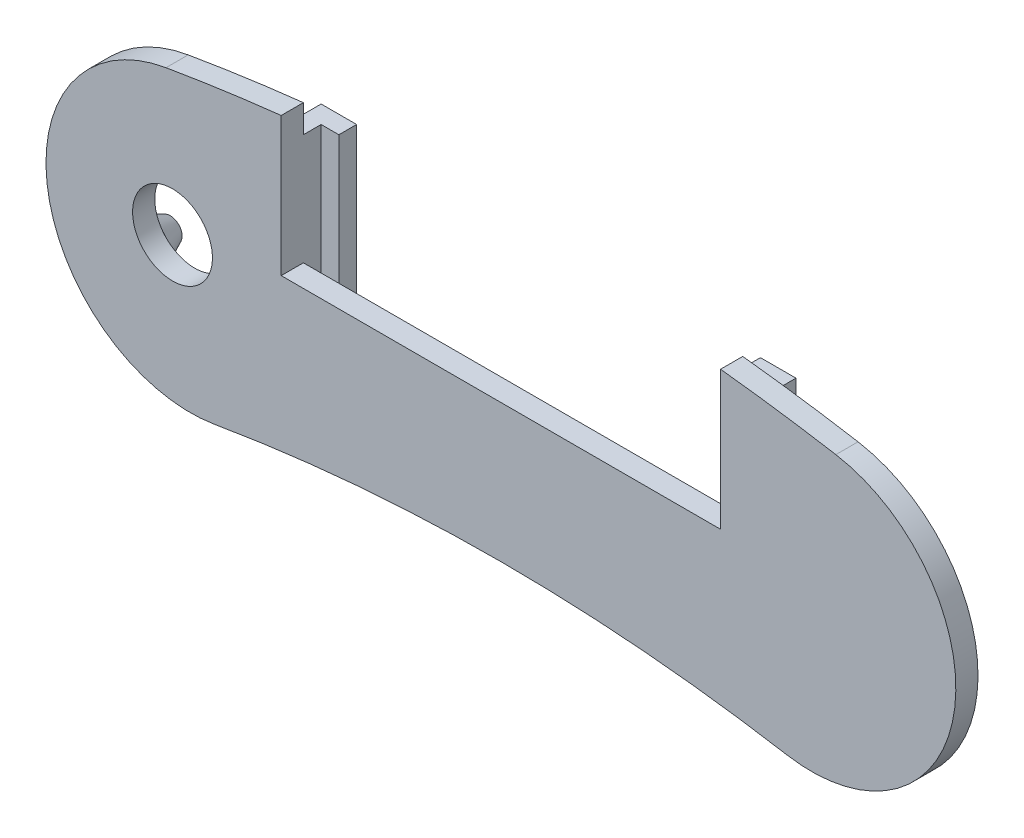
ISO-10303-21;
HEADER;
FILE_DESCRIPTION(('STEP AP214'),'2;1');
FILE_NAME('part.step','',(''),(''),'','','');
FILE_SCHEMA(('AUTOMOTIVE_DESIGN { 1 0 10303 214 1 1 1 1 }'));
ENDSEC;
DATA;
#1=APPLICATION_CONTEXT('core data for automotive mechanical design processes');
#2=APPLICATION_PROTOCOL_DEFINITION('international standard','automotive_design',2000,#1);
#3=PRODUCT_CONTEXT('',#1,'mechanical');
#4=PRODUCT('Part','Part','',(#3));
#5=PRODUCT_RELATED_PRODUCT_CATEGORY('part','',(#4));
#6=PRODUCT_DEFINITION_FORMATION('','',#4);
#7=PRODUCT_DEFINITION_CONTEXT('part definition',#1,'design');
#8=PRODUCT_DEFINITION('design','',#6,#7);
#9=PRODUCT_DEFINITION_SHAPE('','',#8);
#10=(LENGTH_UNIT() NAMED_UNIT(*) SI_UNIT(.MILLI.,.METRE.));
#11=(NAMED_UNIT(*) PLANE_ANGLE_UNIT() SI_UNIT($,.RADIAN.));
#12=(NAMED_UNIT(*) SI_UNIT($,.STERADIAN.) SOLID_ANGLE_UNIT());
#13=UNCERTAINTY_MEASURE_WITH_UNIT(LENGTH_MEASURE(1.E-05),#10,'distance_accuracy_value','');
#14=(GEOMETRIC_REPRESENTATION_CONTEXT(3) GLOBAL_UNCERTAINTY_ASSIGNED_CONTEXT((#13)) GLOBAL_UNIT_ASSIGNED_CONTEXT((#10,
#11,#12)) REPRESENTATION_CONTEXT('',''));
#15=CARTESIAN_POINT('',(0.,0.,0.));
#16=DIRECTION('',(0.,0.,1.));
#17=DIRECTION('',(1.,0.,0.));
#18=AXIS2_PLACEMENT_3D('',#15,#16,#17);
#19=CARTESIAN_POINT('',(-49.4212414035713,413.535495505561,10.));
#20=DIRECTION('',(-1.,0.,0.));
#21=DIRECTION('',(0.,-1.,0.));
#22=AXIS2_PLACEMENT_3D('',#19,#20,#21);
#23=PLANE('',#22);
#24=DIRECTION('',(0.,-1.,0.));
#25=VECTOR('',#24,1.);
#26=CARTESIAN_POINT('',(-49.4212414035713,383.535495505561,-4.));
#27=LINE('',#26,#25);
#28=CARTESIAN_POINT('',(-49.4212414035713,438.535495505561,-4.));
#29=VERTEX_POINT('',#28);
#30=CARTESIAN_POINT('',(-49.4212414035713,383.535495505561,-4.));
#31=VERTEX_POINT('',#30);
#32=EDGE_CURVE('E244',#29,#31,#27,.T.);
#33=ORIENTED_EDGE('',*,*,#32,.F.);
#34=DIRECTION('',(0.,0.,1.));
#35=VECTOR('',#34,1.);
#36=CARTESIAN_POINT('',(-49.4212414035713,438.535495505561,-8.));
#37=LINE('',#36,#35);
#38=CARTESIAN_POINT('',(-49.4212414035713,438.535495505561,0.));
#39=VERTEX_POINT('',#38);
#40=EDGE_CURVE('E63',#29,#39,#37,.T.);
#41=ORIENTED_EDGE('',*,*,#40,.T.);
#42=DIRECTION('',(0.,1.,0.));
#43=VECTOR('',#42,1.);
#44=CARTESIAN_POINT('',(-49.4212414035713,413.535495505561,0.));
#45=LINE('',#44,#43);
#46=CARTESIAN_POINT('',(-49.4212414035713,444.798350114946,0.));
#47=VERTEX_POINT('',#46);
#48=EDGE_CURVE('E213',#39,#47,#45,.T.);
#49=ORIENTED_EDGE('',*,*,#48,.T.);
#50=DIRECTION('',(0.,0.,-1.));
#51=VECTOR('',#50,1.);
#52=CARTESIAN_POINT('',(-49.4212414035713,444.798350114946,5.));
#53=LINE('',#52,#51);
#54=CARTESIAN_POINT('',(-49.4212414035713,444.798350114946,5.));
#55=VERTEX_POINT('',#54);
#56=EDGE_CURVE('E388',#55,#47,#53,.T.);
#57=ORIENTED_EDGE('',*,*,#56,.F.);
#58=DIRECTION('',(0.,-1.,0.));
#59=VECTOR('',#58,1.);
#60=CARTESIAN_POINT('',(-49.4212414035712,204.518453424494,5.));
#61=LINE('',#60,#59);
#62=CARTESIAN_POINT('',(-49.4212414035713,413.535495505561,5.));
#63=VERTEX_POINT('',#62);
#64=EDGE_CURVE('E419',#55,#63,#61,.T.);
#65=ORIENTED_EDGE('',*,*,#64,.T.);
#66=DIRECTION('',(0.,0.,-1.));
#67=VECTOR('',#66,1.);
#68=CARTESIAN_POINT('',(-49.4212414035713,413.535495505561,10.));
#69=LINE('',#68,#67);
#70=CARTESIAN_POINT('',(-49.4212414035713,413.535495505561,0.));
#71=VERTEX_POINT('',#70);
#72=EDGE_CURVE('E422',#63,#71,#69,.T.);
#73=ORIENTED_EDGE('',*,*,#72,.T.);
#74=DIRECTION('',(0.,-1.,0.));
#75=VECTOR('',#74,1.);
#76=CARTESIAN_POINT('',(-49.4212414035713,438.535495505561,0.));
#77=LINE('',#76,#75);
#78=CARTESIAN_POINT('',(-49.4212414035713,383.535495505561,0.));
#79=VERTEX_POINT('',#78);
#80=EDGE_CURVE('E293',#71,#79,#77,.T.);
#81=ORIENTED_EDGE('',*,*,#80,.T.);
#82=DIRECTION('',(0.,0.,1.));
#83=VECTOR('',#82,1.);
#84=CARTESIAN_POINT('',(-49.4212414035713,383.535495505561,-8.));
#85=LINE('',#84,#83);
#86=EDGE_CURVE('E325',#31,#79,#85,.T.);
#87=ORIENTED_EDGE('',*,*,#86,.F.);
#88=EDGE_LOOP('',(#33,#41,#49,#57,#65,#73,#81,#87));
#89=FACE_BOUND('',#88,.T.);
#90=ADVANCED_FACE('F39',(#89),#23,.F.);
#91=CARTESIAN_POINT('',(49.6029206584224,413.535495505561,10.));
#92=DIRECTION('',(-1.,0.,0.));
#93=DIRECTION('',(0.,0.,1.));
#94=AXIS2_PLACEMENT_3D('',#91,#92,#93);
#95=PLANE('',#94);
#96=DIRECTION('',(0.,0.,1.));
#97=VECTOR('',#96,1.);
#98=CARTESIAN_POINT('',(49.6029206584224,438.535495505561,-8.));
#99=LINE('',#98,#97);
#100=CARTESIAN_POINT('',(49.6029206584224,438.535495505561,-4.));
#101=VERTEX_POINT('',#100);
#102=CARTESIAN_POINT('',(49.6029206584224,438.535495505561,0.));
#103=VERTEX_POINT('',#102);
#104=EDGE_CURVE('E358',#101,#103,#99,.T.);
#105=ORIENTED_EDGE('',*,*,#104,.F.);
#106=DIRECTION('',(0.,1.,0.));
#107=VECTOR('',#106,1.);
#108=CARTESIAN_POINT('',(49.6029206584224,438.535495505561,-4.));
#109=LINE('',#108,#107);
#110=CARTESIAN_POINT('',(49.6029206584224,383.535495505561,-3.99999999999999));
#111=VERTEX_POINT('',#110);
#112=EDGE_CURVE('E269',#111,#101,#109,.T.);
#113=ORIENTED_EDGE('',*,*,#112,.F.);
#114=DIRECTION('',(0.,0.,1.));
#115=VECTOR('',#114,1.);
#116=CARTESIAN_POINT('',(49.6029206584223,383.535495505561,-8.));
#117=LINE('',#116,#115);
#118=CARTESIAN_POINT('',(49.6029206584223,383.535495505561,0.));
#119=VERTEX_POINT('',#118);
#120=EDGE_CURVE('E361',#111,#119,#117,.T.);
#121=ORIENTED_EDGE('',*,*,#120,.T.);
#122=DIRECTION('',(0.,1.,0.));
#123=VECTOR('',#122,1.);
#124=CARTESIAN_POINT('',(49.6029206584224,438.535495505561,0.));
#125=LINE('',#124,#123);
#126=CARTESIAN_POINT('',(49.6029206584224,413.535495505561,0.));
#127=VERTEX_POINT('',#126);
#128=EDGE_CURVE('E348',#119,#127,#125,.T.);
#129=ORIENTED_EDGE('',*,*,#128,.T.);
#130=DIRECTION('',(0.,0.,-1.));
#131=VECTOR('',#130,1.);
#132=CARTESIAN_POINT('',(49.6029206584224,413.535495505561,10.));
#133=LINE('',#132,#131);
#134=CARTESIAN_POINT('',(49.6029206584224,413.535495505561,5.));
#135=VERTEX_POINT('',#134);
#136=EDGE_CURVE('E423',#135,#127,#133,.T.);
#137=ORIENTED_EDGE('',*,*,#136,.F.);
#138=DIRECTION('',(0.,-1.,0.));
#139=VECTOR('',#138,1.);
#140=CARTESIAN_POINT('',(49.6029206584224,204.518453424494,5.));
#141=LINE('',#140,#139);
#142=CARTESIAN_POINT('',(49.6029206584224,444.778126293327,5.));
#143=VERTEX_POINT('',#142);
#144=EDGE_CURVE('E412',#143,#135,#141,.T.);
#145=ORIENTED_EDGE('',*,*,#144,.F.);
#146=DIRECTION('',(0.,0.,-1.));
#147=VECTOR('',#146,1.);
#148=CARTESIAN_POINT('',(49.6029206584224,444.778126293327,5.));
#149=LINE('',#148,#147);
#150=CARTESIAN_POINT('',(49.6029206584224,444.778126293327,0.));
#151=VERTEX_POINT('',#150);
#152=EDGE_CURVE('E429',#143,#151,#149,.T.);
#153=ORIENTED_EDGE('',*,*,#152,.T.);
#154=DIRECTION('',(0.,1.,0.));
#155=VECTOR('',#154,1.);
#156=CARTESIAN_POINT('',(49.6029206584224,413.535495505561,0.));
#157=LINE('',#156,#155);
#158=EDGE_CURVE('E220',#103,#151,#157,.T.);
#159=ORIENTED_EDGE('',*,*,#158,.F.);
#160=EDGE_LOOP('',(#105,#113,#121,#129,#137,#145,#153,#159));
#161=FACE_BOUND('',#160,.T.);
#162=ADVANCED_FACE('F453',(#161),#95,.T.);
#163=CARTESIAN_POINT('',(35.0492825725854,204.518453424494,0.));
#164=DIRECTION('',(0.,0.,1.));
#165=DIRECTION('',(1.,0.,0.));
#166=AXIS2_PLACEMENT_3D('',#163,#164,#165);
#167=PLANE('',#166);
#168=CARTESIAN_POINT('',(-73.9212414035713,429.238260820818,0.));
#169=DIRECTION('',(0.,0.,1.));
#170=DIRECTION('',(1.,0.,0.));
#171=AXIS2_PLACEMENT_3D('',#168,#169,#170);
#172=CIRCLE('',#171,5.00000000000001);
#173=CARTESIAN_POINT('',(-68.9212414035713,429.238260820818,0.));
#174=VERTEX_POINT('',#173);
#175=EDGE_CURVE('E11',#174,#174,#172,.F.);
#176=ORIENTED_EDGE('',*,*,#175,.F.);
#177=EDGE_LOOP('',(#176));
#178=FACE_BOUND('',#177,.T.);
#179=CARTESIAN_POINT('',(-84.4212414035713,400.070641788748,0.));
#180=DIRECTION('',(0.,0.,1.));
#181=DIRECTION('',(1.,0.,0.));
#182=AXIS2_PLACEMENT_3D('',#179,#180,#181);
#183=CIRCLE('',#182,5.00000000000001);
#184=CARTESIAN_POINT('',(-80.2730955537952,402.862215898275,0.));
#185=VERTEX_POINT('',#184);
#186=CARTESIAN_POINT('',(-81.095709482766,403.804384876281,0.));
#187=VERTEX_POINT('',#186);
#188=EDGE_CURVE('E217',#185,#187,#183,.F.);
#189=ORIENTED_EDGE('',*,*,#188,.F.);
#190=CARTESIAN_POINT('',(-73.9212414035713,409.238260820818,0.));
#191=DIRECTION('',(0.,0.,-1.));
#192=DIRECTION('',(-1.,0.,0.));
#193=AXIS2_PLACEMENT_3D('',#190,#191,#192);
#194=CIRCLE('',#193,9.00000000000001);
#195=CARTESIAN_POINT('',(-67.5693872533474,402.862215898275,0.));
#196=VERTEX_POINT('',#195);
#197=EDGE_CURVE('E55',#196,#185,#194,.T.);
#198=ORIENTED_EDGE('',*,*,#197,.F.);
#199=CARTESIAN_POINT('',(-63.4212414035713,400.070641788748,0.));
#200=DIRECTION('',(0.,0.,1.));
#201=DIRECTION('',(1.,0.,0.));
#202=AXIS2_PLACEMENT_3D('',#199,#200,#201);
#203=CIRCLE('',#202,5.00000000000001);
#204=CARTESIAN_POINT('',(-66.7467733243765,403.804384876281,0.));
#205=VERTEX_POINT('',#204);
#206=EDGE_CURVE('E208',#205,#196,#203,.F.);
#207=ORIENTED_EDGE('',*,*,#206,.F.);
#208=EDGE_CURVE('E190',#187,#205,#194,.T.);
#209=ORIENTED_EDGE('',*,*,#208,.F.);
#210=EDGE_LOOP('',(#189,#198,#207,#209));
#211=FACE_BOUND('',#210,.T.);
#212=ORIENTED_EDGE('',*,*,#80,.F.);
#213=DIRECTION('',(1.,0.,0.));
#214=VECTOR('',#213,1.);
#215=CARTESIAN_POINT('',(-49.4212414035713,413.535495505561,0.));
#216=LINE('',#215,#214);
#217=EDGE_CURVE('E428',#71,#127,#216,.T.);
#218=ORIENTED_EDGE('',*,*,#217,.T.);
#219=ORIENTED_EDGE('',*,*,#128,.F.);
#220=DIRECTION('',(-1.,0.,0.));
#221=VECTOR('',#220,1.);
#222=CARTESIAN_POINT('',(53.6029206584223,383.535495505561,0.));
#223=LINE('',#222,#221);
#224=CARTESIAN_POINT('',(53.6029206584223,383.535495505561,0.));
#225=VERTEX_POINT('',#224);
#226=EDGE_CURVE('E344',#225,#119,#223,.T.);
#227=ORIENTED_EDGE('',*,*,#226,.F.);
#228=DIRECTION('',(0.,-1.,0.));
#229=VECTOR('',#228,1.);
#230=CARTESIAN_POINT('',(53.6029206584223,438.535495505561,0.));
#231=LINE('',#230,#229);
#232=CARTESIAN_POINT('',(53.6029206584223,438.535495505561,0.));
#233=VERTEX_POINT('',#232);
#234=EDGE_CURVE('E328',#233,#225,#231,.T.);
#235=ORIENTED_EDGE('',*,*,#234,.F.);
#236=DIRECTION('',(1.,0.,0.));
#237=VECTOR('',#236,1.);
#238=CARTESIAN_POINT('',(53.6029206584223,438.535495505561,0.));
#239=LINE('',#238,#237);
#240=EDGE_CURVE('E334',#103,#233,#239,.T.);
#241=ORIENTED_EDGE('',*,*,#240,.F.);
#242=ORIENTED_EDGE('',*,*,#158,.T.);
#243=CARTESIAN_POINT('',(0.,0.,0.));
#244=DIRECTION('',(0.,0.,1.));
#245=DIRECTION('',(1.,0.,0.));
#246=AXIS2_PLACEMENT_3D('',#243,#244,#245);
#247=CIRCLE('',#246,447.535508498318);
#248=CARTESIAN_POINT('',(75.5942096319194,441.104915906606,0.));
#249=VERTEX_POINT('',#248);
#250=EDGE_CURVE('E372',#249,#151,#247,.T.);
#251=ORIENTED_EDGE('',*,*,#250,.F.);
#252=CARTESIAN_POINT('',(70.0985651451709,409.036906848989,0.));
#253=DIRECTION('',(0.,0.,1.));
#254=DIRECTION('',(1.,0.,0.));
#255=AXIS2_PLACEMENT_3D('',#252,#253,#254);
#256=CIRCLE('',#255,32.5355084983184);
#257=CARTESIAN_POINT('',(64.6029206584223,376.968897791371,0.));
#258=VERTEX_POINT('',#257);
#259=EDGE_CURVE('E389',#258,#249,#256,.T.);
#260=ORIENTED_EDGE('',*,*,#259,.F.);
#261=CARTESIAN_POINT('',(0.,0.,0.));
#262=DIRECTION('',(0.,0.,-1.));
#263=DIRECTION('',(1.,0.,0.));
#264=AXIS2_PLACEMENT_3D('',#261,#262,#263);
#265=CIRCLE('',#264,382.464491501681);
#266=CARTESIAN_POINT('',(-64.4212414035713,376.999987951807,0.));
#267=VERTEX_POINT('',#266);
#268=EDGE_CURVE('E377',#267,#258,#265,.T.);
#269=ORIENTED_EDGE('',*,*,#268,.F.);
#270=CARTESIAN_POINT('',(-69.9014307903785,409.070641788748,0.));
#271=DIRECTION('',(0.,0.,1.));
#272=DIRECTION('',(1.,0.,0.));
#273=AXIS2_PLACEMENT_3D('',#270,#271,#272);
#274=CIRCLE('',#273,32.5355084983184);
#275=CARTESIAN_POINT('',(-75.3816201771856,441.141295625688,0.));
#276=VERTEX_POINT('',#275);
#277=EDGE_CURVE('E378',#276,#267,#274,.T.);
#278=ORIENTED_EDGE('',*,*,#277,.F.);
#279=EDGE_CURVE('E394',#47,#276,#247,.T.);
#280=ORIENTED_EDGE('',*,*,#279,.F.);
#281=ORIENTED_EDGE('',*,*,#48,.F.);
#282=DIRECTION('',(1.,0.,0.));
#283=VECTOR('',#282,1.);
#284=CARTESIAN_POINT('',(-49.4212414035713,438.535495505561,0.));
#285=LINE('',#284,#283);
#286=CARTESIAN_POINT('',(-53.4212414035713,438.535495505561,0.));
#287=VERTEX_POINT('',#286);
#288=EDGE_CURVE('E298',#287,#39,#285,.T.);
#289=ORIENTED_EDGE('',*,*,#288,.F.);
#290=DIRECTION('',(0.,1.,0.));
#291=VECTOR('',#290,1.);
#292=CARTESIAN_POINT('',(-53.4212414035713,438.535495505561,0.));
#293=LINE('',#292,#291);
#294=CARTESIAN_POINT('',(-53.4212414035713,383.535495505561,0.));
#295=VERTEX_POINT('',#294);
#296=EDGE_CURVE('E310',#295,#287,#293,.T.);
#297=ORIENTED_EDGE('',*,*,#296,.F.);
#298=DIRECTION('',(-1.,0.,0.));
#299=VECTOR('',#298,1.);
#300=CARTESIAN_POINT('',(-49.4212414035713,383.535495505561,0.));
#301=LINE('',#300,#299);
#302=EDGE_CURVE('E307',#79,#295,#301,.T.);
#303=ORIENTED_EDGE('',*,*,#302,.F.);
#304=EDGE_LOOP('',(#212,#218,#219,#227,#235,#241,#242,#251,#260,#269,#278,#280,#281,#289,#297,#303));
#305=FACE_BOUND('',#304,.T.);
#306=ADVANCED_FACE('F209',(#178,#211,#305),#167,.F.);
#307=CARTESIAN_POINT('',(0.,0.,5.));
#308=DIRECTION('',(0.,0.,-1.));
#309=DIRECTION('',(-1.,0.,0.));
#310=AXIS2_PLACEMENT_3D('',#307,#308,#309);
#311=CYLINDRICAL_SURFACE('',#310,447.535508498318);
#312=ORIENTED_EDGE('',*,*,#152,.F.);
#313=CARTESIAN_POINT('',(0.,0.,5.));
#314=DIRECTION('',(0.,0.,1.));
#315=DIRECTION('',(1.,0.,0.));
#316=AXIS2_PLACEMENT_3D('',#313,#314,#315);
#317=CIRCLE('',#316,447.535508498318);
#318=CARTESIAN_POINT('',(75.5942096319194,441.104915906606,5.));
#319=VERTEX_POINT('',#318);
#320=EDGE_CURVE('E408',#319,#143,#317,.T.);
#321=ORIENTED_EDGE('',*,*,#320,.F.);
#322=DIRECTION('',(0.,0.,-1.));
#323=VECTOR('',#322,1.);
#324=CARTESIAN_POINT('',(75.5942096319194,441.104915906606,5.));
#325=LINE('',#324,#323);
#326=EDGE_CURVE('E368',#319,#249,#325,.T.);
#327=ORIENTED_EDGE('',*,*,#326,.T.);
#328=ORIENTED_EDGE('',*,*,#250,.T.);
#329=EDGE_LOOP('',(#312,#321,#327,#328));
#330=FACE_BOUND('',#329,.T.);
#331=ADVANCED_FACE('F456',(#330),#311,.T.);
#332=CARTESIAN_POINT('',(70.0985651451709,409.036906848989,5.));
#333=DIRECTION('',(0.,0.,-1.));
#334=DIRECTION('',(-1.,0.,0.));
#335=AXIS2_PLACEMENT_3D('',#332,#333,#334);
#336=CYLINDRICAL_SURFACE('',#335,32.5355084983184);
#337=ORIENTED_EDGE('',*,*,#259,.T.);
#338=ORIENTED_EDGE('',*,*,#326,.F.);
#339=CARTESIAN_POINT('',(70.0985651451709,409.036906848989,5.));
#340=DIRECTION('',(0.,0.,1.));
#341=DIRECTION('',(1.,0.,0.));
#342=AXIS2_PLACEMENT_3D('',#339,#340,#341);
#343=CIRCLE('',#342,32.5355084983184);
#344=CARTESIAN_POINT('',(64.6029206584223,376.968897791371,5.));
#345=VERTEX_POINT('',#344);
#346=EDGE_CURVE('E404',#345,#319,#343,.T.);
#347=ORIENTED_EDGE('',*,*,#346,.F.);
#348=DIRECTION('',(0.,0.,-1.));
#349=VECTOR('',#348,1.);
#350=CARTESIAN_POINT('',(64.6029206584223,376.968897791371,5.));
#351=LINE('',#350,#349);
#352=EDGE_CURVE('E384',#345,#258,#351,.T.);
#353=ORIENTED_EDGE('',*,*,#352,.T.);
#354=EDGE_LOOP('',(#337,#338,#347,#353));
#355=FACE_BOUND('',#354,.T.);
#356=ADVANCED_FACE('F460',(#355),#336,.T.);
#357=CARTESIAN_POINT('',(-75.3816201771856,441.141295625688,5.));
#358=VERTEX_POINT('',#357);
#359=EDGE_CURVE('E383',#55,#358,#317,.T.);
#360=ORIENTED_EDGE('',*,*,#359,.F.);
#361=ORIENTED_EDGE('',*,*,#56,.T.);
#362=ORIENTED_EDGE('',*,*,#279,.T.);
#363=DIRECTION('',(0.,0.,-1.));
#364=VECTOR('',#363,1.);
#365=CARTESIAN_POINT('',(-75.3816201771856,441.141295625688,5.));
#366=LINE('',#365,#364);
#367=EDGE_CURVE('E373',#358,#276,#366,.T.);
#368=ORIENTED_EDGE('',*,*,#367,.F.);
#369=EDGE_LOOP('',(#360,#361,#362,#368));
#370=FACE_BOUND('',#369,.T.);
#371=ADVANCED_FACE('F41',(#370),#311,.T.);
#372=CARTESIAN_POINT('',(-69.9014307903785,409.070641788748,5.));
#373=DIRECTION('',(0.,0.,-1.));
#374=DIRECTION('',(-1.,0.,0.));
#375=AXIS2_PLACEMENT_3D('',#372,#373,#374);
#376=CYLINDRICAL_SURFACE('',#375,32.5355084983184);
#377=ORIENTED_EDGE('',*,*,#277,.T.);
#378=DIRECTION('',(0.,0.,-1.));
#379=VECTOR('',#378,1.);
#380=CARTESIAN_POINT('',(-64.4212414035713,376.999987951807,5.));
#381=LINE('',#380,#379);
#382=CARTESIAN_POINT('',(-64.4212414035713,376.999987951807,5.));
#383=VERTEX_POINT('',#382);
#384=EDGE_CURVE('E379',#383,#267,#381,.T.);
#385=ORIENTED_EDGE('',*,*,#384,.F.);
#386=CARTESIAN_POINT('',(-69.9014307903785,409.070641788748,5.));
#387=DIRECTION('',(0.,0.,1.));
#388=DIRECTION('',(1.,0.,0.));
#389=AXIS2_PLACEMENT_3D('',#386,#387,#388);
#390=CIRCLE('',#389,32.5355084983184);
#391=EDGE_CURVE('E405',#358,#383,#390,.T.);
#392=ORIENTED_EDGE('',*,*,#391,.F.);
#393=ORIENTED_EDGE('',*,*,#367,.T.);
#394=EDGE_LOOP('',(#377,#385,#392,#393));
#395=FACE_BOUND('',#394,.T.);
#396=ADVANCED_FACE('F471',(#395),#376,.T.);
#397=CARTESIAN_POINT('',(0.,0.,5.));
#398=DIRECTION('',(0.,0.,-1.));
#399=DIRECTION('',(-1.,0.,0.));
#400=AXIS2_PLACEMENT_3D('',#397,#398,#399);
#401=CYLINDRICAL_SURFACE('',#400,382.464491501681);
#402=ORIENTED_EDGE('',*,*,#268,.T.);
#403=ORIENTED_EDGE('',*,*,#352,.F.);
#404=CARTESIAN_POINT('',(0.,0.,5.));
#405=DIRECTION('',(0.,0.,-1.));
#406=DIRECTION('',(1.,0.,0.));
#407=AXIS2_PLACEMENT_3D('',#404,#405,#406);
#408=CIRCLE('',#407,382.464491501681);
#409=EDGE_CURVE('E401',#383,#345,#408,.T.);
#410=ORIENTED_EDGE('',*,*,#409,.F.);
#411=ORIENTED_EDGE('',*,*,#384,.T.);
#412=EDGE_LOOP('',(#402,#403,#410,#411));
#413=FACE_BOUND('',#412,.T.);
#414=ADVANCED_FACE('F466',(#413),#401,.F.);
#415=CARTESIAN_POINT('',(35.0492825725854,204.518453424494,5.));
#416=DIRECTION('',(0.,0.,1.));
#417=DIRECTION('',(1.,0.,0.));
#418=AXIS2_PLACEMENT_3D('',#415,#416,#417);
#419=PLANE('',#418);
#420=CARTESIAN_POINT('',(-73.9212414035713,409.238260820818,5.));
#421=DIRECTION('',(0.,0.,-1.));
#422=DIRECTION('',(-1.,0.,0.));
#423=AXIS2_PLACEMENT_3D('',#420,#421,#422);
#424=CIRCLE('',#423,9.00000000000001);
#425=CARTESIAN_POINT('',(-82.9212414035713,409.238260820818,5.));
#426=VERTEX_POINT('',#425);
#427=EDGE_CURVE('E206',#426,#426,#424,.T.);
#428=ORIENTED_EDGE('',*,*,#427,.T.);
#429=EDGE_LOOP('',(#428));
#430=FACE_BOUND('',#429,.T.);
#431=ORIENTED_EDGE('',*,*,#64,.F.);
#432=ORIENTED_EDGE('',*,*,#359,.T.);
#433=ORIENTED_EDGE('',*,*,#391,.T.);
#434=ORIENTED_EDGE('',*,*,#409,.T.);
#435=ORIENTED_EDGE('',*,*,#346,.T.);
#436=ORIENTED_EDGE('',*,*,#320,.T.);
#437=ORIENTED_EDGE('',*,*,#144,.T.);
#438=DIRECTION('',(-1.,0.,0.));
#439=VECTOR('',#438,1.);
#440=CARTESIAN_POINT('',(35.0492825725854,413.535495505561,5.));
#441=LINE('',#440,#439);
#442=EDGE_CURVE('E424',#135,#63,#441,.T.);
#443=ORIENTED_EDGE('',*,*,#442,.T.);
#444=EDGE_LOOP('',(#431,#432,#433,#434,#435,#436,#437,#443));
#445=FACE_BOUND('',#444,.T.);
#446=ADVANCED_FACE('F481',(#430,#445),#419,.T.);
#447=CARTESIAN_POINT('',(-49.4212414035713,413.535495505561,10.));
#448=DIRECTION('',(0.,1.,0.));
#449=DIRECTION('',(0.,0.,1.));
#450=AXIS2_PLACEMENT_3D('',#447,#448,#449);
#451=PLANE('',#450);
#452=ORIENTED_EDGE('',*,*,#136,.T.);
#453=ORIENTED_EDGE('',*,*,#217,.F.);
#454=ORIENTED_EDGE('',*,*,#72,.F.);
#455=ORIENTED_EDGE('',*,*,#442,.F.);
#456=EDGE_LOOP('',(#452,#453,#454,#455));
#457=FACE_BOUND('',#456,.T.);
#458=ADVANCED_FACE('F497',(#457),#451,.T.);
#459=CARTESIAN_POINT('',(53.6029206584223,438.535495505561,-8.));
#460=DIRECTION('',(-1.,0.,0.));
#461=DIRECTION('',(0.,-1.,0.));
#462=AXIS2_PLACEMENT_3D('',#459,#460,#461);
#463=PLANE('',#462);
#464=ORIENTED_EDGE('',*,*,#234,.T.);
#465=DIRECTION('',(0.,0.,1.));
#466=VECTOR('',#465,1.);
#467=CARTESIAN_POINT('',(53.6029206584223,383.535495505561,-8.));
#468=LINE('',#467,#466);
#469=CARTESIAN_POINT('',(53.6029206584223,383.535495505561,-8.));
#470=VERTEX_POINT('',#469);
#471=EDGE_CURVE('E364',#470,#225,#468,.T.);
#472=ORIENTED_EDGE('',*,*,#471,.F.);
#473=DIRECTION('',(0.,-1.,0.));
#474=VECTOR('',#473,1.);
#475=CARTESIAN_POINT('',(53.6029206584223,438.535495505561,-8.));
#476=LINE('',#475,#474);
#477=CARTESIAN_POINT('',(53.6029206584223,438.535495505561,-8.));
#478=VERTEX_POINT('',#477);
#479=EDGE_CURVE('E329',#478,#470,#476,.T.);
#480=ORIENTED_EDGE('',*,*,#479,.F.);
#481=DIRECTION('',(0.,0.,1.));
#482=VECTOR('',#481,1.);
#483=CARTESIAN_POINT('',(53.6029206584223,438.535495505561,-8.));
#484=LINE('',#483,#482);
#485=EDGE_CURVE('E340',#478,#233,#484,.T.);
#486=ORIENTED_EDGE('',*,*,#485,.T.);
#487=EDGE_LOOP('',(#464,#472,#480,#486));
#488=FACE_BOUND('',#487,.T.);
#489=ADVANCED_FACE('F499',(#488),#463,.F.);
#490=CARTESIAN_POINT('',(53.6029206584223,383.535495505561,-8.));
#491=DIRECTION('',(0.,1.,0.));
#492=DIRECTION('',(0.,0.,1.));
#493=AXIS2_PLACEMENT_3D('',#490,#491,#492);
#494=PLANE('',#493);
#495=ORIENTED_EDGE('',*,*,#226,.T.);
#496=ORIENTED_EDGE('',*,*,#120,.F.);
#497=DIRECTION('',(1.,0.,0.));
#498=VECTOR('',#497,1.);
#499=CARTESIAN_POINT('',(45.6029206584223,383.535495505561,-3.99999999999999));
#500=LINE('',#499,#498);
#501=CARTESIAN_POINT('',(45.6029206584223,383.535495505561,-3.99999999999999));
#502=VERTEX_POINT('',#501);
#503=EDGE_CURVE('E290',#502,#111,#500,.T.);
#504=ORIENTED_EDGE('',*,*,#503,.F.);
#505=DIRECTION('',(0.,0.,1.));
#506=VECTOR('',#505,1.);
#507=CARTESIAN_POINT('',(45.6029206584223,383.535495505561,-7.99999999999999));
#508=LINE('',#507,#506);
#509=CARTESIAN_POINT('',(45.6029206584223,383.535495505561,-7.99999999999999));
#510=VERTEX_POINT('',#509);
#511=EDGE_CURVE('E274',#510,#502,#508,.T.);
#512=ORIENTED_EDGE('',*,*,#511,.F.);
#513=DIRECTION('',(-1.,0.,0.));
#514=VECTOR('',#513,1.);
#515=CARTESIAN_POINT('',(53.6029206584223,383.535495505561,-8.));
#516=LINE('',#515,#514);
#517=EDGE_CURVE('E333',#470,#510,#516,.T.);
#518=ORIENTED_EDGE('',*,*,#517,.F.);
#519=ORIENTED_EDGE('',*,*,#471,.T.);
#520=EDGE_LOOP('',(#495,#496,#504,#512,#518,#519));
#521=FACE_BOUND('',#520,.T.);
#522=ADVANCED_FACE('F515',(#521),#494,.F.);
#523=CARTESIAN_POINT('',(53.6029206584223,438.535495505561,-8.));
#524=DIRECTION('',(0.,-1.,0.));
#525=DIRECTION('',(0.,0.,-1.));
#526=AXIS2_PLACEMENT_3D('',#523,#524,#525);
#527=PLANE('',#526);
#528=ORIENTED_EDGE('',*,*,#240,.T.);
#529=ORIENTED_EDGE('',*,*,#485,.F.);
#530=DIRECTION('',(1.,0.,0.));
#531=VECTOR('',#530,1.);
#532=CARTESIAN_POINT('',(53.6029206584223,438.535495505561,-8.));
#533=LINE('',#532,#531);
#534=CARTESIAN_POINT('',(45.6029206584223,438.535495505561,-8.));
#535=VERTEX_POINT('',#534);
#536=EDGE_CURVE('E337',#535,#478,#533,.T.);
#537=ORIENTED_EDGE('',*,*,#536,.F.);
#538=DIRECTION('',(0.,0.,-1.));
#539=VECTOR('',#538,1.);
#540=CARTESIAN_POINT('',(45.6029206584223,438.535495505561,-8.));
#541=LINE('',#540,#539);
#542=CARTESIAN_POINT('',(45.6029206584223,438.535495505561,-4.));
#543=VERTEX_POINT('',#542);
#544=EDGE_CURVE('E280',#543,#535,#541,.T.);
#545=ORIENTED_EDGE('',*,*,#544,.F.);
#546=DIRECTION('',(1.,0.,0.));
#547=VECTOR('',#546,1.);
#548=CARTESIAN_POINT('',(45.6029206584223,438.535495505561,-4.));
#549=LINE('',#548,#547);
#550=EDGE_CURVE('E284',#543,#101,#549,.T.);
#551=ORIENTED_EDGE('',*,*,#550,.T.);
#552=ORIENTED_EDGE('',*,*,#104,.T.);
#553=EDGE_LOOP('',(#528,#529,#537,#545,#551,#552));
#554=FACE_BOUND('',#553,.T.);
#555=ADVANCED_FACE('F519',(#554),#527,.F.);
#556=CARTESIAN_POINT('',(0.,0.,-8.));
#557=DIRECTION('',(0.,0.,-1.));
#558=DIRECTION('',(-1.,0.,0.));
#559=AXIS2_PLACEMENT_3D('',#556,#557,#558);
#560=PLANE('',#559);
#561=ORIENTED_EDGE('',*,*,#479,.T.);
#562=ORIENTED_EDGE('',*,*,#517,.T.);
#563=DIRECTION('',(0.,-1.,0.));
#564=VECTOR('',#563,1.);
#565=CARTESIAN_POINT('',(45.6029206584223,438.535495505561,-8.));
#566=LINE('',#565,#564);
#567=EDGE_CURVE('E270',#535,#510,#566,.T.);
#568=ORIENTED_EDGE('',*,*,#567,.F.);
#569=ORIENTED_EDGE('',*,*,#536,.T.);
#570=EDGE_LOOP('',(#561,#562,#568,#569));
#571=FACE_BOUND('',#570,.T.);
#572=ADVANCED_FACE('F523',(#571),#560,.T.);
#573=CARTESIAN_POINT('',(-49.4212414035713,383.535495505561,-8.));
#574=DIRECTION('',(0.,1.,0.));
#575=DIRECTION('',(0.,0.,1.));
#576=AXIS2_PLACEMENT_3D('',#573,#574,#575);
#577=PLANE('',#576);
#578=ORIENTED_EDGE('',*,*,#302,.T.);
#579=DIRECTION('',(0.,0.,1.));
#580=VECTOR('',#579,1.);
#581=CARTESIAN_POINT('',(-53.4212414035713,383.535495505561,-8.));
#582=LINE('',#581,#580);
#583=CARTESIAN_POINT('',(-53.4212414035713,383.535495505561,-8.));
#584=VERTEX_POINT('',#583);
#585=EDGE_CURVE('E321',#584,#295,#582,.T.);
#586=ORIENTED_EDGE('',*,*,#585,.F.);
#587=DIRECTION('',(-1.,0.,0.));
#588=VECTOR('',#587,1.);
#589=CARTESIAN_POINT('',(-49.4212414035713,383.535495505561,-8.));
#590=LINE('',#589,#588);
#591=CARTESIAN_POINT('',(-45.4212414035713,383.535495505561,-8.));
#592=VERTEX_POINT('',#591);
#593=EDGE_CURVE('E294',#592,#584,#590,.T.);
#594=ORIENTED_EDGE('',*,*,#593,.F.);
#595=DIRECTION('',(0.,0.,-1.));
#596=VECTOR('',#595,1.);
#597=CARTESIAN_POINT('',(-45.4212414035713,383.535495505561,-4.));
#598=LINE('',#597,#596);
#599=CARTESIAN_POINT('',(-45.4212414035713,383.535495505561,-4.));
#600=VERTEX_POINT('',#599);
#601=EDGE_CURVE('E249',#600,#592,#598,.T.);
#602=ORIENTED_EDGE('',*,*,#601,.F.);
#603=DIRECTION('',(-1.,0.,0.));
#604=VECTOR('',#603,1.);
#605=CARTESIAN_POINT('',(-45.4212414035713,383.535495505561,-4.));
#606=LINE('',#605,#604);
#607=EDGE_CURVE('E266',#600,#31,#606,.T.);
#608=ORIENTED_EDGE('',*,*,#607,.T.);
#609=ORIENTED_EDGE('',*,*,#86,.T.);
#610=EDGE_LOOP('',(#578,#586,#594,#602,#608,#609));
#611=FACE_BOUND('',#610,.T.);
#612=ADVANCED_FACE('F527',(#611),#577,.F.);
#613=CARTESIAN_POINT('',(-53.4212414035713,438.535495505561,-8.));
#614=DIRECTION('',(1.,0.,0.));
#615=DIRECTION('',(0.,1.,0.));
#616=AXIS2_PLACEMENT_3D('',#613,#614,#615);
#617=PLANE('',#616);
#618=ORIENTED_EDGE('',*,*,#296,.T.);
#619=DIRECTION('',(0.,0.,1.));
#620=VECTOR('',#619,1.);
#621=CARTESIAN_POINT('',(-53.4212414035713,438.535495505561,-8.));
#622=LINE('',#621,#620);
#623=CARTESIAN_POINT('',(-53.4212414035713,438.535495505561,-8.));
#624=VERTEX_POINT('',#623);
#625=EDGE_CURVE('E317',#624,#287,#622,.T.);
#626=ORIENTED_EDGE('',*,*,#625,.F.);
#627=DIRECTION('',(0.,1.,0.));
#628=VECTOR('',#627,1.);
#629=CARTESIAN_POINT('',(-53.4212414035713,438.535495505561,-8.));
#630=LINE('',#629,#628);
#631=EDGE_CURVE('E297',#584,#624,#630,.T.);
#632=ORIENTED_EDGE('',*,*,#631,.F.);
#633=ORIENTED_EDGE('',*,*,#585,.T.);
#634=EDGE_LOOP('',(#618,#626,#632,#633));
#635=FACE_BOUND('',#634,.T.);
#636=ADVANCED_FACE('F531',(#635),#617,.F.);
#637=CARTESIAN_POINT('',(-49.4212414035713,438.535495505561,-8.));
#638=DIRECTION('',(0.,-1.,0.));
#639=DIRECTION('',(0.,0.,-1.));
#640=AXIS2_PLACEMENT_3D('',#637,#638,#639);
#641=PLANE('',#640);
#642=ORIENTED_EDGE('',*,*,#288,.T.);
#643=ORIENTED_EDGE('',*,*,#40,.F.);
#644=DIRECTION('',(-1.,0.,0.));
#645=VECTOR('',#644,1.);
#646=CARTESIAN_POINT('',(-45.4212414035713,438.535495505561,-4.));
#647=LINE('',#646,#645);
#648=CARTESIAN_POINT('',(-45.4212414035713,438.535495505561,-4.));
#649=VERTEX_POINT('',#648);
#650=EDGE_CURVE('E260',#649,#29,#647,.T.);
#651=ORIENTED_EDGE('',*,*,#650,.F.);
#652=DIRECTION('',(0.,0.,1.));
#653=VECTOR('',#652,1.);
#654=CARTESIAN_POINT('',(-45.4212414035713,438.535495505561,-4.));
#655=LINE('',#654,#653);
#656=CARTESIAN_POINT('',(-45.4212414035713,438.535495505561,-8.));
#657=VERTEX_POINT('',#656);
#658=EDGE_CURVE('E257',#657,#649,#655,.T.);
#659=ORIENTED_EDGE('',*,*,#658,.F.);
#660=DIRECTION('',(1.,0.,0.));
#661=VECTOR('',#660,1.);
#662=CARTESIAN_POINT('',(-49.4212414035713,438.535495505561,-8.));
#663=LINE('',#662,#661);
#664=EDGE_CURVE('E301',#624,#657,#663,.T.);
#665=ORIENTED_EDGE('',*,*,#664,.F.);
#666=ORIENTED_EDGE('',*,*,#625,.T.);
#667=EDGE_LOOP('',(#642,#643,#651,#659,#665,#666));
#668=FACE_BOUND('',#667,.T.);
#669=ADVANCED_FACE('F535',(#668),#641,.F.);
#670=CARTESIAN_POINT('',(0.,0.,-8.));
#671=DIRECTION('',(0.,0.,-1.));
#672=DIRECTION('',(-1.,0.,0.));
#673=AXIS2_PLACEMENT_3D('',#670,#671,#672);
#674=PLANE('',#673);
#675=ORIENTED_EDGE('',*,*,#664,.T.);
#676=DIRECTION('',(0.,1.,0.));
#677=VECTOR('',#676,1.);
#678=CARTESIAN_POINT('',(-45.4212414035713,383.535495505561,-8.));
#679=LINE('',#678,#677);
#680=EDGE_CURVE('E253',#592,#657,#679,.T.);
#681=ORIENTED_EDGE('',*,*,#680,.F.);
#682=ORIENTED_EDGE('',*,*,#593,.T.);
#683=ORIENTED_EDGE('',*,*,#631,.T.);
#684=EDGE_LOOP('',(#675,#681,#682,#683));
#685=FACE_BOUND('',#684,.T.);
#686=ADVANCED_FACE('F539',(#685),#674,.T.);
#687=CARTESIAN_POINT('',(45.6029206584223,438.535495505561,-4.));
#688=DIRECTION('',(0.,0.,-1.));
#689=DIRECTION('',(0.,1.,0.));
#690=AXIS2_PLACEMENT_3D('',#687,#688,#689);
#691=PLANE('',#690);
#692=ORIENTED_EDGE('',*,*,#112,.T.);
#693=ORIENTED_EDGE('',*,*,#550,.F.);
#694=DIRECTION('',(0.,1.,0.));
#695=VECTOR('',#694,1.);
#696=CARTESIAN_POINT('',(45.6029206584223,438.535495505561,-4.));
#697=LINE('',#696,#695);
#698=EDGE_CURVE('E277',#502,#543,#697,.T.);
#699=ORIENTED_EDGE('',*,*,#698,.F.);
#700=ORIENTED_EDGE('',*,*,#503,.T.);
#701=EDGE_LOOP('',(#692,#693,#699,#700));
#702=FACE_BOUND('',#701,.T.);
#703=ADVANCED_FACE('F543',(#702),#691,.F.);
#704=CARTESIAN_POINT('',(45.6029206584223,0.,0.));
#705=DIRECTION('',(-1.,0.,0.));
#706=DIRECTION('',(0.,0.,1.));
#707=AXIS2_PLACEMENT_3D('',#704,#705,#706);
#708=PLANE('',#707);
#709=ORIENTED_EDGE('',*,*,#567,.T.);
#710=ORIENTED_EDGE('',*,*,#511,.T.);
#711=ORIENTED_EDGE('',*,*,#698,.T.);
#712=ORIENTED_EDGE('',*,*,#544,.T.);
#713=EDGE_LOOP('',(#709,#710,#711,#712));
#714=FACE_BOUND('',#713,.T.);
#715=ADVANCED_FACE('F547',(#714),#708,.T.);
#716=CARTESIAN_POINT('',(-45.4212414035713,383.535495505561,-4.));
#717=DIRECTION('',(0.,0.,-1.));
#718=DIRECTION('',(-1.,0.,0.));
#719=AXIS2_PLACEMENT_3D('',#716,#717,#718);
#720=PLANE('',#719);
#721=ORIENTED_EDGE('',*,*,#32,.T.);
#722=ORIENTED_EDGE('',*,*,#607,.F.);
#723=DIRECTION('',(0.,-1.,0.));
#724=VECTOR('',#723,1.);
#725=CARTESIAN_POINT('',(-45.4212414035713,383.535495505561,-4.));
#726=LINE('',#725,#724);
#727=EDGE_CURVE('E245',#649,#600,#726,.T.);
#728=ORIENTED_EDGE('',*,*,#727,.F.);
#729=ORIENTED_EDGE('',*,*,#650,.T.);
#730=EDGE_LOOP('',(#721,#722,#728,#729));
#731=FACE_BOUND('',#730,.T.);
#732=ADVANCED_FACE('F551',(#731),#720,.F.);
#733=CARTESIAN_POINT('',(-45.4212414035712,0.,0.));
#734=DIRECTION('',(-1.,0.,0.));
#735=DIRECTION('',(0.,-1.,0.));
#736=AXIS2_PLACEMENT_3D('',#733,#734,#735);
#737=PLANE('',#736);
#738=ORIENTED_EDGE('',*,*,#727,.T.);
#739=ORIENTED_EDGE('',*,*,#601,.T.);
#740=ORIENTED_EDGE('',*,*,#680,.T.);
#741=ORIENTED_EDGE('',*,*,#658,.T.);
#742=EDGE_LOOP('',(#738,#739,#740,#741));
#743=FACE_BOUND('',#742,.T.);
#744=ADVANCED_FACE('F555',(#743),#737,.F.);
#745=CARTESIAN_POINT('',(-63.4212414035713,400.070641788748,0.));
#746=DIRECTION('',(0.,0.,1.));
#747=DIRECTION('',(-1.,0.,0.));
#748=AXIS2_PLACEMENT_3D('',#745,#746,#747);
#749=CONICAL_SURFACE('',#748,5.00000000000001,0.436332312998583);
#750=CARTESIAN_POINT('',(-63.4212414035713,400.070641788748,-5.));
#751=DIRECTION('',(0.,0.,-1.));
#752=DIRECTION('',(-1.,0.,0.));
#753=AXIS2_PLACEMENT_3D('',#750,#751,#752);
#754=CIRCLE('',#753,2.66846170922501);
#755=CARTESIAN_POINT('',(-66.0897031127963,400.070641788748,-5.));
#756=VERTEX_POINT('',#755);
#757=EDGE_CURVE('E240',#756,#756,#754,.T.);
#758=ORIENTED_EDGE('',*,*,#757,.F.);
#759=EDGE_LOOP('',(#758));
#760=FACE_BOUND('',#759,.T.);
#761=EDGE_CURVE('E204',#196,#205,#203,.F.);
#762=ORIENTED_EDGE('',*,*,#761,.T.);
#763=ORIENTED_EDGE('',*,*,#206,.T.);
#764=EDGE_LOOP('',(#762,#763));
#765=FACE_BOUND('',#764,.T.);
#766=ADVANCED_FACE('F215',(#760,#765),#749,.T.);
#767=CARTESIAN_POINT('',(-63.4212414035713,400.070641788748,-5.));
#768=DIRECTION('',(0.,0.,-1.));
#769=DIRECTION('',(-1.,0.,0.));
#770=AXIS2_PLACEMENT_3D('',#767,#768,#769);
#771=PLANE('',#770);
#772=ORIENTED_EDGE('',*,*,#757,.T.);
#773=EDGE_LOOP('',(#772));
#774=FACE_BOUND('',#773,.T.);
#775=ADVANCED_FACE('F562',(#774),#771,.T.);
#776=CARTESIAN_POINT('',(-84.4212414035713,400.070641788748,0.));
#777=DIRECTION('',(0.,0.,1.));
#778=DIRECTION('',(-1.,0.,0.));
#779=AXIS2_PLACEMENT_3D('',#776,#777,#778);
#780=CONICAL_SURFACE('',#779,5.00000000000001,0.436332312998583);
#781=CARTESIAN_POINT('',(-84.4212414035713,400.070641788748,-5.));
#782=DIRECTION('',(0.,0.,-1.));
#783=DIRECTION('',(-1.,0.,0.));
#784=AXIS2_PLACEMENT_3D('',#781,#782,#783);
#785=CIRCLE('',#784,2.66846170922501);
#786=CARTESIAN_POINT('',(-87.0897031127963,400.070641788748,-5.));
#787=VERTEX_POINT('',#786);
#788=EDGE_CURVE('E236',#787,#787,#785,.T.);
#789=ORIENTED_EDGE('',*,*,#788,.F.);
#790=EDGE_LOOP('',(#789));
#791=FACE_BOUND('',#790,.T.);
#792=EDGE_CURVE('E48',#187,#185,#183,.F.);
#793=ORIENTED_EDGE('',*,*,#792,.T.);
#794=ORIENTED_EDGE('',*,*,#188,.T.);
#795=EDGE_LOOP('',(#793,#794));
#796=FACE_BOUND('',#795,.T.);
#797=ADVANCED_FACE('F225',(#791,#796),#780,.T.);
#798=CARTESIAN_POINT('',(-84.4212414035713,400.070641788748,-5.));
#799=DIRECTION('',(0.,0.,-1.));
#800=DIRECTION('',(-1.,0.,0.));
#801=AXIS2_PLACEMENT_3D('',#798,#799,#800);
#802=PLANE('',#801);
#803=ORIENTED_EDGE('',*,*,#788,.T.);
#804=EDGE_LOOP('',(#803));
#805=FACE_BOUND('',#804,.T.);
#806=ADVANCED_FACE('F569',(#805),#802,.T.);
#807=CARTESIAN_POINT('',(-73.9212414035713,429.238260820818,0.));
#808=DIRECTION('',(0.,0.,1.));
#809=DIRECTION('',(-1.,0.,0.));
#810=AXIS2_PLACEMENT_3D('',#807,#808,#809);
#811=CONICAL_SURFACE('',#810,5.00000000000001,0.436332312998583);
#812=CARTESIAN_POINT('',(-73.9212414035713,429.238260820818,-5.));
#813=DIRECTION('',(0.,0.,-1.));
#814=DIRECTION('',(-1.,0.,0.));
#815=AXIS2_PLACEMENT_3D('',#812,#813,#814);
#816=CIRCLE('',#815,2.66846170922501);
#817=CARTESIAN_POINT('',(-76.5897031127963,429.238260820818,-5.));
#818=VERTEX_POINT('',#817);
#819=EDGE_CURVE('E232',#818,#818,#816,.T.);
#820=ORIENTED_EDGE('',*,*,#819,.F.);
#821=EDGE_LOOP('',(#820));
#822=FACE_BOUND('',#821,.T.);
#823=ORIENTED_EDGE('',*,*,#175,.T.);
#824=EDGE_LOOP('',(#823));
#825=FACE_BOUND('',#824,.T.);
#826=ADVANCED_FACE('F573',(#822,#825),#811,.T.);
#827=CARTESIAN_POINT('',(-73.9212414035713,429.238260820818,-5.));
#828=DIRECTION('',(0.,0.,-1.));
#829=DIRECTION('',(-1.,0.,0.));
#830=AXIS2_PLACEMENT_3D('',#827,#828,#829);
#831=PLANE('',#830);
#832=ORIENTED_EDGE('',*,*,#819,.T.);
#833=EDGE_LOOP('',(#832));
#834=FACE_BOUND('',#833,.T.);
#835=ADVANCED_FACE('F576',(#834),#831,.T.);
#836=CARTESIAN_POINT('',(-73.9212414035713,409.238260820818,0.));
#837=DIRECTION('',(0.,0.,-1.));
#838=DIRECTION('',(-1.,0.,0.));
#839=AXIS2_PLACEMENT_3D('',#836,#837,#838);
#840=PLANE('',#839);
#841=EDGE_CURVE('E193',#205,#196,#194,.T.);
#842=ORIENTED_EDGE('',*,*,#841,.F.);
#843=ORIENTED_EDGE('',*,*,#761,.F.);
#844=EDGE_LOOP('',(#842,#843));
#845=FACE_BOUND('',#844,.T.);
#846=ADVANCED_FACE('F202',(#845),#840,.F.);
#847=EDGE_CURVE('E194',#185,#187,#194,.T.);
#848=ORIENTED_EDGE('',*,*,#847,.F.);
#849=ORIENTED_EDGE('',*,*,#792,.F.);
#850=EDGE_LOOP('',(#848,#849));
#851=FACE_BOUND('',#850,.T.);
#852=ADVANCED_FACE('F227',(#851),#840,.F.);
#853=CARTESIAN_POINT('',(-73.9212414035713,409.238260820818,5.));
#854=DIRECTION('',(0.,0.,-1.));
#855=DIRECTION('',(-1.,0.,0.));
#856=AXIS2_PLACEMENT_3D('',#853,#854,#855);
#857=CYLINDRICAL_SURFACE('',#856,9.00000000000001);
#858=ORIENTED_EDGE('',*,*,#427,.F.);
#859=EDGE_LOOP('',(#858));
#860=FACE_BOUND('',#859,.T.);
#861=ORIENTED_EDGE('',*,*,#841,.T.);
#862=ORIENTED_EDGE('',*,*,#197,.T.);
#863=ORIENTED_EDGE('',*,*,#847,.T.);
#864=ORIENTED_EDGE('',*,*,#208,.T.);
#865=EDGE_LOOP('',(#861,#862,#863,#864));
#866=FACE_BOUND('',#865,.T.);
#867=ADVANCED_FACE('F192',(#860,#866),#857,.F.);
#868=CLOSED_SHELL('',(#90,#162,#306,#331,#356,#371,#396,#414,#446,#458,#489,#522,#555,#572,#612,
#636,#669,#686,#703,#715,#732,#744,#766,#775,#797,#806,#826,#835,#846,#852,#867));
#869=MANIFOLD_SOLID_BREP('B2',#868);
#870=ADVANCED_BREP_SHAPE_REPRESENTATION('',(#18,#869),#14);
#871=SHAPE_DEFINITION_REPRESENTATION(#9,#870);
ENDSEC;
END-ISO-10303-21;
